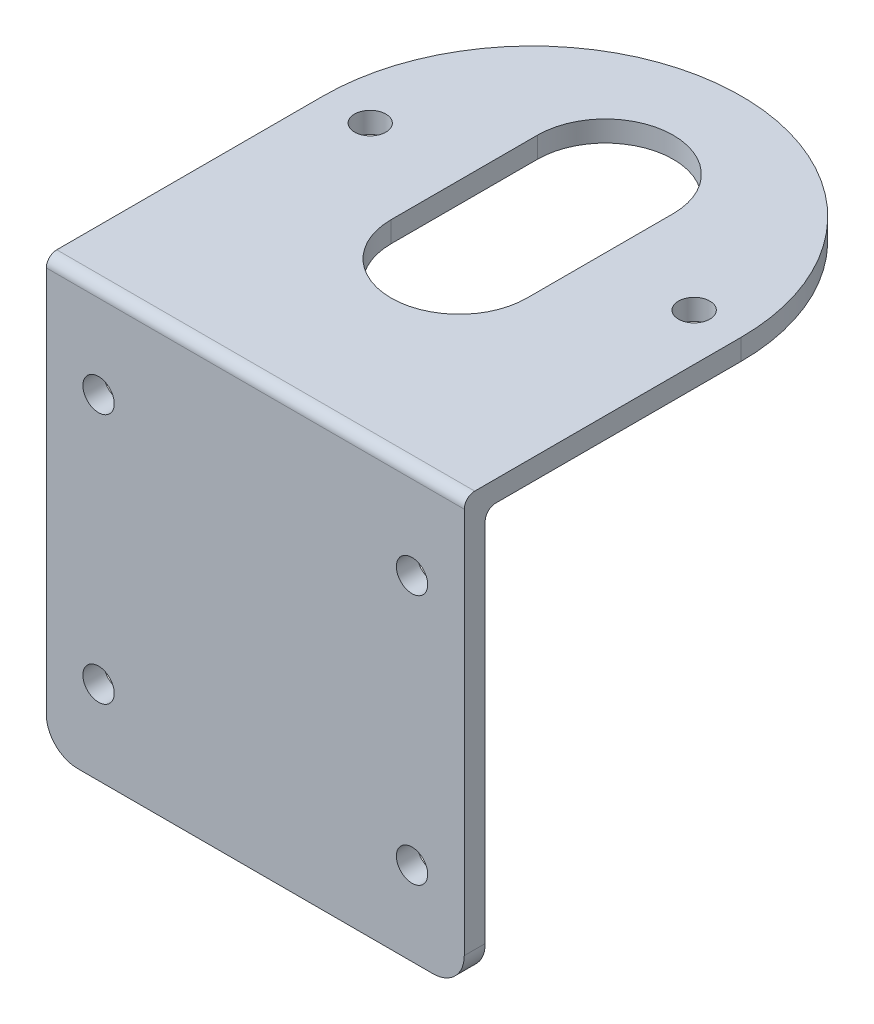
ISO-10303-21;
HEADER;
FILE_DESCRIPTION(('STEP AP214'),'2;1');
FILE_NAME('part.step','',(''),(''),'','','');
FILE_SCHEMA(('AUTOMOTIVE_DESIGN { 1 0 10303 214 1 1 1 1 }'));
ENDSEC;
DATA;
#1=APPLICATION_CONTEXT('core data for automotive mechanical design processes');
#2=APPLICATION_PROTOCOL_DEFINITION('international standard','automotive_design',2000,#1);
#3=PRODUCT_CONTEXT('',#1,'mechanical');
#4=PRODUCT('Part','Part','',(#3));
#5=PRODUCT_RELATED_PRODUCT_CATEGORY('part','',(#4));
#6=PRODUCT_DEFINITION_FORMATION('','',#4);
#7=PRODUCT_DEFINITION_CONTEXT('part definition',#1,'design');
#8=PRODUCT_DEFINITION('design','',#6,#7);
#9=PRODUCT_DEFINITION_SHAPE('','',#8);
#10=(LENGTH_UNIT() NAMED_UNIT(*) SI_UNIT(.MILLI.,.METRE.));
#11=(NAMED_UNIT(*) PLANE_ANGLE_UNIT() SI_UNIT($,.RADIAN.));
#12=(NAMED_UNIT(*) SI_UNIT($,.STERADIAN.) SOLID_ANGLE_UNIT());
#13=UNCERTAINTY_MEASURE_WITH_UNIT(LENGTH_MEASURE(1.E-05),#10,'distance_accuracy_value','');
#14=(GEOMETRIC_REPRESENTATION_CONTEXT(3) GLOBAL_UNCERTAINTY_ASSIGNED_CONTEXT((#13)) GLOBAL_UNIT_ASSIGNED_CONTEXT((#10,
#11,#12)) REPRESENTATION_CONTEXT('',''));
#15=CARTESIAN_POINT('',(0.,0.,0.));
#16=DIRECTION('',(0.,0.,1.));
#17=DIRECTION('',(1.,0.,0.));
#18=AXIS2_PLACEMENT_3D('',#15,#16,#17);
#19=CARTESIAN_POINT('',(0.,0.,0.));
#20=DIRECTION('',(0.,0.,1.));
#21=DIRECTION('',(1.,0.,0.));
#22=AXIS2_PLACEMENT_3D('',#19,#20,#21);
#23=PLANE('',#22);
#24=CARTESIAN_POINT('',(-15.,11.5,0.));
#25=DIRECTION('',(0.,0.,1.));
#26=DIRECTION('',(1.,0.,0.));
#27=AXIS2_PLACEMENT_3D('',#24,#25,#26);
#28=CIRCLE('',#27,1.5);
#29=CARTESIAN_POINT('',(-13.5,11.5,0.));
#30=VERTEX_POINT('',#29);
#31=EDGE_CURVE('E205',#30,#30,#28,.T.);
#32=ORIENTED_EDGE('',*,*,#31,.T.);
#33=EDGE_LOOP('',(#32));
#34=FACE_BOUND('',#33,.T.);
#35=CARTESIAN_POINT('',(-15.,-12.5,0.));
#36=DIRECTION('',(0.,0.,1.));
#37=DIRECTION('',(1.,0.,0.));
#38=AXIS2_PLACEMENT_3D('',#35,#36,#37);
#39=CIRCLE('',#38,1.5);
#40=CARTESIAN_POINT('',(-13.5,-12.5,0.));
#41=VERTEX_POINT('',#40);
#42=EDGE_CURVE('E202',#41,#41,#39,.T.);
#43=ORIENTED_EDGE('',*,*,#42,.T.);
#44=EDGE_LOOP('',(#43));
#45=FACE_BOUND('',#44,.T.);
#46=CARTESIAN_POINT('',(15.,-12.5,0.));
#47=DIRECTION('',(0.,0.,1.));
#48=DIRECTION('',(1.,0.,0.));
#49=AXIS2_PLACEMENT_3D('',#46,#47,#48);
#50=CIRCLE('',#49,1.5);
#51=CARTESIAN_POINT('',(16.5,-12.5,0.));
#52=VERTEX_POINT('',#51);
#53=EDGE_CURVE('E198',#52,#52,#50,.T.);
#54=ORIENTED_EDGE('',*,*,#53,.T.);
#55=EDGE_LOOP('',(#54));
#56=FACE_BOUND('',#55,.T.);
#57=CARTESIAN_POINT('',(15.,11.5,0.));
#58=DIRECTION('',(0.,0.,1.));
#59=DIRECTION('',(1.,0.,0.));
#60=AXIS2_PLACEMENT_3D('',#57,#58,#59);
#61=CIRCLE('',#60,1.5);
#62=CARTESIAN_POINT('',(16.5,11.5,0.));
#63=VERTEX_POINT('',#62);
#64=EDGE_CURVE('E195',#63,#63,#61,.T.);
#65=ORIENTED_EDGE('',*,*,#64,.T.);
#66=EDGE_LOOP('',(#65));
#67=FACE_BOUND('',#66,.T.);
#68=DIRECTION('',(-1.,0.,0.));
#69=VECTOR('',#68,1.);
#70=CARTESIAN_POINT('',(0.,-20.5,0.));
#71=LINE('',#70,#69);
#72=CARTESIAN_POINT('',(17.,-20.5,0.));
#73=VERTEX_POINT('',#72);
#74=CARTESIAN_POINT('',(-17.,-20.5,0.));
#75=VERTEX_POINT('',#74);
#76=EDGE_CURVE('E180',#73,#75,#71,.T.);
#77=ORIENTED_EDGE('',*,*,#76,.T.);
#78=CARTESIAN_POINT('',(-17.,-17.5,0.));
#79=DIRECTION('',(0.,0.,1.));
#80=DIRECTION('',(1.,0.,0.));
#81=AXIS2_PLACEMENT_3D('',#78,#79,#80);
#82=CIRCLE('',#81,3.);
#83=CARTESIAN_POINT('',(-20.,-17.5,0.));
#84=VERTEX_POINT('',#83);
#85=EDGE_CURVE('E242',#75,#84,#82,.F.);
#86=ORIENTED_EDGE('',*,*,#85,.T.);
#87=DIRECTION('',(0.,1.,0.));
#88=VECTOR('',#87,1.);
#89=CARTESIAN_POINT('',(-20.,0.,0.));
#90=LINE('',#89,#88);
#91=CARTESIAN_POINT('',(-20.,17.5,0.));
#92=VERTEX_POINT('',#91);
#93=EDGE_CURVE('E210',#84,#92,#90,.T.);
#94=ORIENTED_EDGE('',*,*,#93,.T.);
#95=DIRECTION('',(-1.,0.,0.));
#96=VECTOR('',#95,1.);
#97=CARTESIAN_POINT('',(20.,17.5,0.));
#98=LINE('',#97,#96);
#99=CARTESIAN_POINT('',(20.,17.5,0.));
#100=VERTEX_POINT('',#99);
#101=EDGE_CURVE('E218',#92,#100,#98,.F.);
#102=ORIENTED_EDGE('',*,*,#101,.T.);
#103=DIRECTION('',(0.,1.,0.));
#104=VECTOR('',#103,1.);
#105=CARTESIAN_POINT('',(20.,0.,0.));
#106=LINE('',#105,#104);
#107=CARTESIAN_POINT('',(20.,-17.5,0.));
#108=VERTEX_POINT('',#107);
#109=EDGE_CURVE('E208',#108,#100,#106,.T.);
#110=ORIENTED_EDGE('',*,*,#109,.F.);
#111=CARTESIAN_POINT('',(17.,-17.5,0.));
#112=DIRECTION('',(0.,0.,1.));
#113=DIRECTION('',(1.,0.,0.));
#114=AXIS2_PLACEMENT_3D('',#111,#112,#113);
#115=CIRCLE('',#114,3.);
#116=EDGE_CURVE('E240',#108,#73,#115,.F.);
#117=ORIENTED_EDGE('',*,*,#116,.T.);
#118=EDGE_LOOP('',(#77,#86,#94,#102,#110,#117));
#119=FACE_BOUND('',#118,.T.);
#120=ADVANCED_FACE('F36',(#34,#45,#56,#67,#119),#23,.F.);
#121=CARTESIAN_POINT('',(20.,0.,2.));
#122=DIRECTION('',(-1.,0.,0.));
#123=DIRECTION('',(0.,-1.,0.));
#124=AXIS2_PLACEMENT_3D('',#121,#122,#123);
#125=PLANE('',#124);
#126=DIRECTION('',(0.,1.,0.));
#127=VECTOR('',#126,1.);
#128=CARTESIAN_POINT('',(20.,0.,2.));
#129=LINE('',#128,#127);
#130=CARTESIAN_POINT('',(20.,-17.5,2.));
#131=VERTEX_POINT('',#130);
#132=CARTESIAN_POINT('',(20.,19.5,2.));
#133=VERTEX_POINT('',#132);
#134=EDGE_CURVE('E189',#131,#133,#129,.T.);
#135=ORIENTED_EDGE('',*,*,#134,.F.);
#136=DIRECTION('',(0.,0.,-1.));
#137=VECTOR('',#136,1.);
#138=CARTESIAN_POINT('',(20.,-17.5,0.));
#139=LINE('',#138,#137);
#140=EDGE_CURVE('E11',#131,#108,#139,.T.);
#141=ORIENTED_EDGE('',*,*,#140,.T.);
#142=ORIENTED_EDGE('',*,*,#109,.T.);
#143=CARTESIAN_POINT('',(20.,17.5,-1.));
#144=DIRECTION('',(-1.,0.,0.));
#145=DIRECTION('',(0.,-1.,0.));
#146=AXIS2_PLACEMENT_3D('',#143,#144,#145);
#147=CIRCLE('',#146,1.);
#148=CARTESIAN_POINT('',(20.,18.5,-1.));
#149=VERTEX_POINT('',#148);
#150=EDGE_CURVE('E233',#100,#149,#147,.T.);
#151=ORIENTED_EDGE('',*,*,#150,.T.);
#152=DIRECTION('',(0.,0.,-1.));
#153=VECTOR('',#152,1.);
#154=CARTESIAN_POINT('',(20.,18.5,0.));
#155=LINE('',#154,#153);
#156=CARTESIAN_POINT('',(20.,18.5,-24.5));
#157=VERTEX_POINT('',#156);
#158=EDGE_CURVE('E314',#149,#157,#155,.T.);
#159=ORIENTED_EDGE('',*,*,#158,.T.);
#160=DIRECTION('',(0.,-1.,0.));
#161=VECTOR('',#160,1.);
#162=CARTESIAN_POINT('',(20.,20.5,-24.5));
#163=LINE('',#162,#161);
#164=CARTESIAN_POINT('',(20.,20.5,-24.5));
#165=VERTEX_POINT('',#164);
#166=EDGE_CURVE('E168',#165,#157,#163,.T.);
#167=ORIENTED_EDGE('',*,*,#166,.F.);
#168=DIRECTION('',(0.,0.,-1.));
#169=VECTOR('',#168,1.);
#170=CARTESIAN_POINT('',(20.,20.5,2.));
#171=LINE('',#170,#169);
#172=CARTESIAN_POINT('',(20.,20.5,1.));
#173=VERTEX_POINT('',#172);
#174=EDGE_CURVE('E150',#173,#165,#171,.T.);
#175=ORIENTED_EDGE('',*,*,#174,.F.);
#176=CARTESIAN_POINT('',(20.,19.5,1.));
#177=DIRECTION('',(-1.,0.,0.));
#178=DIRECTION('',(0.,-1.,0.));
#179=AXIS2_PLACEMENT_3D('',#176,#177,#178);
#180=CIRCLE('',#179,1.);
#181=EDGE_CURVE('E223',#173,#133,#180,.F.);
#182=ORIENTED_EDGE('',*,*,#181,.T.);
#183=EDGE_LOOP('',(#135,#141,#142,#151,#159,#167,#175,#182));
#184=FACE_BOUND('',#183,.T.);
#185=ADVANCED_FACE('F264',(#184),#125,.F.);
#186=CARTESIAN_POINT('',(0.,20.5,2.));
#187=DIRECTION('',(0.,1.,0.));
#188=DIRECTION('',(-1.,0.,0.));
#189=AXIS2_PLACEMENT_3D('',#186,#187,#188);
#190=PLANE('',#189);
#191=DIRECTION('',(0.,0.,-1.));
#192=VECTOR('',#191,1.);
#193=CARTESIAN_POINT('',(-20.,20.5,2.));
#194=LINE('',#193,#192);
#195=CARTESIAN_POINT('',(-20.,20.5,1.));
#196=VERTEX_POINT('',#195);
#197=CARTESIAN_POINT('',(-20.,20.5,-24.5));
#198=VERTEX_POINT('',#197);
#199=EDGE_CURVE('E138',#196,#198,#194,.T.);
#200=ORIENTED_EDGE('',*,*,#199,.F.);
#201=DIRECTION('',(1.,0.,0.));
#202=VECTOR('',#201,1.);
#203=CARTESIAN_POINT('',(0.,20.5,1.));
#204=LINE('',#203,#202);
#205=EDGE_CURVE('E221',#196,#173,#204,.T.);
#206=ORIENTED_EDGE('',*,*,#205,.T.);
#207=ORIENTED_EDGE('',*,*,#174,.T.);
#208=CARTESIAN_POINT('',(0.,20.5,-24.5));
#209=DIRECTION('',(0.,1.,0.));
#210=DIRECTION('',(-1.,0.,0.));
#211=AXIS2_PLACEMENT_3D('',#208,#209,#210);
#212=CIRCLE('',#211,20.);
#213=EDGE_CURVE('E154',#165,#198,#212,.T.);
#214=ORIENTED_EDGE('',*,*,#213,.T.);
#215=EDGE_LOOP('',(#200,#206,#207,#214));
#216=FACE_BOUND('',#215,.T.);
#217=CARTESIAN_POINT('',(15.5,20.5,-24.5));
#218=DIRECTION('',(0.,1.,0.));
#219=DIRECTION('',(-1.,0.,0.));
#220=AXIS2_PLACEMENT_3D('',#217,#218,#219);
#221=CIRCLE('',#220,1.50175896182333);
#222=CARTESIAN_POINT('',(13.9982410381767,20.5,-24.5));
#223=VERTEX_POINT('',#222);
#224=EDGE_CURVE('E172',#223,#223,#221,.T.);
#225=ORIENTED_EDGE('',*,*,#224,.F.);
#226=EDGE_LOOP('',(#225));
#227=FACE_BOUND('',#226,.T.);
#228=CARTESIAN_POINT('',(0.,20.5,-17.5));
#229=DIRECTION('',(0.,1.,0.));
#230=DIRECTION('',(-1.,0.,0.));
#231=AXIS2_PLACEMENT_3D('',#228,#229,#230);
#232=CIRCLE('',#231,6.5);
#233=CARTESIAN_POINT('',(-6.49999999999999,20.5,-17.5));
#234=VERTEX_POINT('',#233);
#235=CARTESIAN_POINT('',(6.50000000000001,20.5,-17.5));
#236=VERTEX_POINT('',#235);
#237=EDGE_CURVE('E366',#234,#236,#232,.T.);
#238=ORIENTED_EDGE('',*,*,#237,.F.);
#239=DIRECTION('',(0.,0.,1.));
#240=VECTOR('',#239,1.);
#241=CARTESIAN_POINT('',(-6.49999999999999,20.5,0.));
#242=LINE('',#241,#240);
#243=CARTESIAN_POINT('',(-6.5,20.5,-31.5));
#244=VERTEX_POINT('',#243);
#245=EDGE_CURVE('E348',#244,#234,#242,.T.);
#246=ORIENTED_EDGE('',*,*,#245,.F.);
#247=CARTESIAN_POINT('',(0.,20.5,-31.5));
#248=DIRECTION('',(0.,1.,0.));
#249=DIRECTION('',(-1.,0.,0.));
#250=AXIS2_PLACEMENT_3D('',#247,#248,#249);
#251=CIRCLE('',#250,6.5);
#252=CARTESIAN_POINT('',(6.5,20.5,-31.5));
#253=VERTEX_POINT('',#252);
#254=EDGE_CURVE('E363',#253,#244,#251,.T.);
#255=ORIENTED_EDGE('',*,*,#254,.F.);
#256=DIRECTION('',(0.,0.,1.));
#257=VECTOR('',#256,1.);
#258=CARTESIAN_POINT('',(6.50000000000001,20.5,0.));
#259=LINE('',#258,#257);
#260=EDGE_CURVE('E368',#253,#236,#259,.T.);
#261=ORIENTED_EDGE('',*,*,#260,.T.);
#262=EDGE_LOOP('',(#238,#246,#255,#261));
#263=FACE_BOUND('',#262,.T.);
#264=CARTESIAN_POINT('',(-15.5,20.5,-24.5));
#265=DIRECTION('',(0.,1.,0.));
#266=DIRECTION('',(-1.,0.,0.));
#267=AXIS2_PLACEMENT_3D('',#264,#265,#266);
#268=CIRCLE('',#267,1.5);
#269=CARTESIAN_POINT('',(-17.,20.5,-24.5));
#270=VERTEX_POINT('',#269);
#271=EDGE_CURVE('E161',#270,#270,#268,.T.);
#272=ORIENTED_EDGE('',*,*,#271,.F.);
#273=EDGE_LOOP('',(#272));
#274=FACE_BOUND('',#273,.T.);
#275=ADVANCED_FACE('F155',(#216,#227,#263,#274),#190,.T.);
#276=CARTESIAN_POINT('',(-20.,0.,2.));
#277=DIRECTION('',(-1.,0.,0.));
#278=DIRECTION('',(0.,0.,1.));
#279=AXIS2_PLACEMENT_3D('',#276,#277,#278);
#280=PLANE('',#279);
#281=ORIENTED_EDGE('',*,*,#93,.F.);
#282=DIRECTION('',(0.,0.,-1.));
#283=VECTOR('',#282,1.);
#284=CARTESIAN_POINT('',(-20.,-17.5,2.));
#285=LINE('',#284,#283);
#286=CARTESIAN_POINT('',(-20.,-17.5,2.));
#287=VERTEX_POINT('',#286);
#288=EDGE_CURVE('E59',#84,#287,#285,.F.);
#289=ORIENTED_EDGE('',*,*,#288,.T.);
#290=DIRECTION('',(0.,1.,0.));
#291=VECTOR('',#290,1.);
#292=CARTESIAN_POINT('',(-20.,0.,2.));
#293=LINE('',#292,#291);
#294=CARTESIAN_POINT('',(-20.,19.5,2.));
#295=VERTEX_POINT('',#294);
#296=EDGE_CURVE('E191',#287,#295,#293,.T.);
#297=ORIENTED_EDGE('',*,*,#296,.T.);
#298=CARTESIAN_POINT('',(-20.,19.5,1.));
#299=DIRECTION('',(-1.,0.,0.));
#300=DIRECTION('',(0.,0.,1.));
#301=AXIS2_PLACEMENT_3D('',#298,#299,#300);
#302=CIRCLE('',#301,1.);
#303=EDGE_CURVE('E146',#295,#196,#302,.T.);
#304=ORIENTED_EDGE('',*,*,#303,.T.);
#305=ORIENTED_EDGE('',*,*,#199,.T.);
#306=DIRECTION('',(0.,-1.,0.));
#307=VECTOR('',#306,1.);
#308=CARTESIAN_POINT('',(-20.,20.5,-24.5));
#309=LINE('',#308,#307);
#310=CARTESIAN_POINT('',(-20.,18.5,-24.5));
#311=VERTEX_POINT('',#310);
#312=EDGE_CURVE('E143',#198,#311,#309,.T.);
#313=ORIENTED_EDGE('',*,*,#312,.T.);
#314=DIRECTION('',(0.,0.,-1.));
#315=VECTOR('',#314,1.);
#316=CARTESIAN_POINT('',(-20.,18.5,0.));
#317=LINE('',#316,#315);
#318=CARTESIAN_POINT('',(-20.,18.5,-1.));
#319=VERTEX_POINT('',#318);
#320=EDGE_CURVE('E257',#319,#311,#317,.T.);
#321=ORIENTED_EDGE('',*,*,#320,.F.);
#322=CARTESIAN_POINT('',(-20.,17.5,-1.));
#323=DIRECTION('',(-1.,0.,0.));
#324=DIRECTION('',(0.,0.,1.));
#325=AXIS2_PLACEMENT_3D('',#322,#323,#324);
#326=CIRCLE('',#325,1.);
#327=EDGE_CURVE('E230',#319,#92,#326,.F.);
#328=ORIENTED_EDGE('',*,*,#327,.T.);
#329=EDGE_LOOP('',(#281,#289,#297,#304,#305,#313,#321,#328));
#330=FACE_BOUND('',#329,.T.);
#331=ADVANCED_FACE('F140',(#330),#280,.T.);
#332=CARTESIAN_POINT('',(-15.,11.5,2.));
#333=DIRECTION('',(0.,0.,-1.));
#334=DIRECTION('',(-1.,0.,0.));
#335=AXIS2_PLACEMENT_3D('',#332,#333,#334);
#336=CYLINDRICAL_SURFACE('',#335,1.5);
#337=CARTESIAN_POINT('',(-15.,11.5,2.));
#338=DIRECTION('',(0.,0.,1.));
#339=DIRECTION('',(1.,0.,0.));
#340=AXIS2_PLACEMENT_3D('',#337,#338,#339);
#341=CIRCLE('',#340,1.5);
#342=CARTESIAN_POINT('',(-13.5,11.5,2.));
#343=VERTEX_POINT('',#342);
#344=EDGE_CURVE('E186',#343,#343,#341,.T.);
#345=ORIENTED_EDGE('',*,*,#344,.T.);
#346=EDGE_LOOP('',(#345));
#347=FACE_BOUND('',#346,.T.);
#348=ORIENTED_EDGE('',*,*,#31,.F.);
#349=EDGE_LOOP('',(#348));
#350=FACE_BOUND('',#349,.T.);
#351=ADVANCED_FACE('F289',(#347,#350),#336,.F.);
#352=CARTESIAN_POINT('',(-15.,-12.5,2.));
#353=DIRECTION('',(0.,0.,-1.));
#354=DIRECTION('',(-1.,0.,0.));
#355=AXIS2_PLACEMENT_3D('',#352,#353,#354);
#356=CYLINDRICAL_SURFACE('',#355,1.5);
#357=CARTESIAN_POINT('',(-15.,-12.5,2.));
#358=DIRECTION('',(0.,0.,1.));
#359=DIRECTION('',(1.,0.,0.));
#360=AXIS2_PLACEMENT_3D('',#357,#358,#359);
#361=CIRCLE('',#360,1.5);
#362=CARTESIAN_POINT('',(-13.5,-12.5,2.));
#363=VERTEX_POINT('',#362);
#364=EDGE_CURVE('E183',#363,#363,#361,.T.);
#365=ORIENTED_EDGE('',*,*,#364,.T.);
#366=EDGE_LOOP('',(#365));
#367=FACE_BOUND('',#366,.T.);
#368=ORIENTED_EDGE('',*,*,#42,.F.);
#369=EDGE_LOOP('',(#368));
#370=FACE_BOUND('',#369,.T.);
#371=ADVANCED_FACE('F294',(#367,#370),#356,.F.);
#372=CARTESIAN_POINT('',(15.,-12.5,2.));
#373=DIRECTION('',(0.,0.,-1.));
#374=DIRECTION('',(-1.,0.,0.));
#375=AXIS2_PLACEMENT_3D('',#372,#373,#374);
#376=CYLINDRICAL_SURFACE('',#375,1.5);
#377=CARTESIAN_POINT('',(15.,-12.5,2.));
#378=DIRECTION('',(0.,0.,1.));
#379=DIRECTION('',(1.,0.,0.));
#380=AXIS2_PLACEMENT_3D('',#377,#378,#379);
#381=CIRCLE('',#380,1.5);
#382=CARTESIAN_POINT('',(16.5,-12.5,2.));
#383=VERTEX_POINT('',#382);
#384=EDGE_CURVE('E179',#383,#383,#381,.T.);
#385=ORIENTED_EDGE('',*,*,#384,.T.);
#386=EDGE_LOOP('',(#385));
#387=FACE_BOUND('',#386,.T.);
#388=ORIENTED_EDGE('',*,*,#53,.F.);
#389=EDGE_LOOP('',(#388));
#390=FACE_BOUND('',#389,.T.);
#391=ADVANCED_FACE('F298',(#387,#390),#376,.F.);
#392=CARTESIAN_POINT('',(15.,11.5,2.));
#393=DIRECTION('',(0.,0.,-1.));
#394=DIRECTION('',(-1.,0.,0.));
#395=AXIS2_PLACEMENT_3D('',#392,#393,#394);
#396=CYLINDRICAL_SURFACE('',#395,1.5);
#397=CARTESIAN_POINT('',(15.,11.5,2.));
#398=DIRECTION('',(0.,0.,1.));
#399=DIRECTION('',(1.,0.,0.));
#400=AXIS2_PLACEMENT_3D('',#397,#398,#399);
#401=CIRCLE('',#400,1.5);
#402=CARTESIAN_POINT('',(16.5,11.5,2.));
#403=VERTEX_POINT('',#402);
#404=EDGE_CURVE('E176',#403,#403,#401,.T.);
#405=ORIENTED_EDGE('',*,*,#404,.T.);
#406=EDGE_LOOP('',(#405));
#407=FACE_BOUND('',#406,.T.);
#408=ORIENTED_EDGE('',*,*,#64,.F.);
#409=EDGE_LOOP('',(#408));
#410=FACE_BOUND('',#409,.T.);
#411=ADVANCED_FACE('F286',(#407,#410),#396,.F.);
#412=CARTESIAN_POINT('',(0.,-20.5,2.));
#413=DIRECTION('',(0.,-1.,0.));
#414=DIRECTION('',(1.,0.,0.));
#415=AXIS2_PLACEMENT_3D('',#412,#413,#414);
#416=PLANE('',#415);
#417=DIRECTION('',(-1.,0.,0.));
#418=VECTOR('',#417,1.);
#419=CARTESIAN_POINT('',(0.,-20.5,2.));
#420=LINE('',#419,#418);
#421=CARTESIAN_POINT('',(17.,-20.5,2.));
#422=VERTEX_POINT('',#421);
#423=CARTESIAN_POINT('',(-17.,-20.5,2.));
#424=VERTEX_POINT('',#423);
#425=EDGE_CURVE('E151',#422,#424,#420,.T.);
#426=ORIENTED_EDGE('',*,*,#425,.T.);
#427=DIRECTION('',(0.,0.,-1.));
#428=VECTOR('',#427,1.);
#429=CARTESIAN_POINT('',(-17.,-20.5,2.));
#430=LINE('',#429,#428);
#431=EDGE_CURVE('E237',#424,#75,#430,.T.);
#432=ORIENTED_EDGE('',*,*,#431,.T.);
#433=ORIENTED_EDGE('',*,*,#76,.F.);
#434=DIRECTION('',(0.,0.,-1.));
#435=VECTOR('',#434,1.);
#436=CARTESIAN_POINT('',(17.,-20.5,2.));
#437=LINE('',#436,#435);
#438=EDGE_CURVE('E235',#73,#422,#437,.F.);
#439=ORIENTED_EDGE('',*,*,#438,.T.);
#440=EDGE_LOOP('',(#426,#432,#433,#439));
#441=FACE_BOUND('',#440,.T.);
#442=ADVANCED_FACE('F251',(#441),#416,.T.);
#443=CARTESIAN_POINT('',(0.,0.,2.));
#444=DIRECTION('',(0.,0.,1.));
#445=DIRECTION('',(1.,0.,0.));
#446=AXIS2_PLACEMENT_3D('',#443,#444,#445);
#447=PLANE('',#446);
#448=ORIENTED_EDGE('',*,*,#296,.F.);
#449=CARTESIAN_POINT('',(-17.,-17.5,2.));
#450=DIRECTION('',(0.,0.,1.));
#451=DIRECTION('',(1.,0.,0.));
#452=AXIS2_PLACEMENT_3D('',#449,#450,#451);
#453=CIRCLE('',#452,3.);
#454=EDGE_CURVE('E44',#287,#424,#453,.T.);
#455=ORIENTED_EDGE('',*,*,#454,.T.);
#456=ORIENTED_EDGE('',*,*,#425,.F.);
#457=CARTESIAN_POINT('',(17.,-17.5,2.));
#458=DIRECTION('',(0.,0.,1.));
#459=DIRECTION('',(1.,0.,0.));
#460=AXIS2_PLACEMENT_3D('',#457,#458,#459);
#461=CIRCLE('',#460,3.);
#462=EDGE_CURVE('E51',#422,#131,#461,.T.);
#463=ORIENTED_EDGE('',*,*,#462,.T.);
#464=ORIENTED_EDGE('',*,*,#134,.T.);
#465=DIRECTION('',(1.,0.,0.));
#466=VECTOR('',#465,1.);
#467=CARTESIAN_POINT('',(0.,19.5,2.));
#468=LINE('',#467,#466);
#469=EDGE_CURVE('E226',#133,#295,#468,.F.);
#470=ORIENTED_EDGE('',*,*,#469,.T.);
#471=EDGE_LOOP('',(#448,#455,#456,#463,#464,#470));
#472=FACE_BOUND('',#471,.T.);
#473=ORIENTED_EDGE('',*,*,#404,.F.);
#474=EDGE_LOOP('',(#473));
#475=FACE_BOUND('',#474,.T.);
#476=ORIENTED_EDGE('',*,*,#384,.F.);
#477=EDGE_LOOP('',(#476));
#478=FACE_BOUND('',#477,.T.);
#479=ORIENTED_EDGE('',*,*,#364,.F.);
#480=EDGE_LOOP('',(#479));
#481=FACE_BOUND('',#480,.T.);
#482=ORIENTED_EDGE('',*,*,#344,.F.);
#483=EDGE_LOOP('',(#482));
#484=FACE_BOUND('',#483,.T.);
#485=ADVANCED_FACE('F246',(#472,#475,#478,#481,#484),#447,.T.);
#486=CARTESIAN_POINT('',(0.,18.5,0.));
#487=DIRECTION('',(0.,1.,0.));
#488=DIRECTION('',(-1.,0.,0.));
#489=AXIS2_PLACEMENT_3D('',#486,#487,#488);
#490=PLANE('',#489);
#491=CARTESIAN_POINT('',(-15.5,18.5,-24.5));
#492=DIRECTION('',(0.,1.,0.));
#493=DIRECTION('',(-1.,0.,0.));
#494=AXIS2_PLACEMENT_3D('',#491,#492,#493);
#495=CIRCLE('',#494,1.5);
#496=CARTESIAN_POINT('',(-17.,18.5,-24.5));
#497=VERTEX_POINT('',#496);
#498=EDGE_CURVE('E323',#497,#497,#495,.T.);
#499=ORIENTED_EDGE('',*,*,#498,.T.);
#500=EDGE_LOOP('',(#499));
#501=FACE_BOUND('',#500,.T.);
#502=CARTESIAN_POINT('',(0.,18.5,-17.5));
#503=DIRECTION('',(0.,1.,0.));
#504=DIRECTION('',(-1.,0.,0.));
#505=AXIS2_PLACEMENT_3D('',#502,#503,#504);
#506=CIRCLE('',#505,6.5);
#507=CARTESIAN_POINT('',(-6.49999999999999,18.5,-17.5));
#508=VERTEX_POINT('',#507);
#509=CARTESIAN_POINT('',(6.50000000000001,18.5,-17.5));
#510=VERTEX_POINT('',#509);
#511=EDGE_CURVE('E326',#508,#510,#506,.T.);
#512=ORIENTED_EDGE('',*,*,#511,.T.);
#513=DIRECTION('',(0.,0.,1.));
#514=VECTOR('',#513,1.);
#515=CARTESIAN_POINT('',(6.50000000000001,18.5,0.));
#516=LINE('',#515,#514);
#517=CARTESIAN_POINT('',(6.5,18.5,-31.5));
#518=VERTEX_POINT('',#517);
#519=EDGE_CURVE('E335',#518,#510,#516,.T.);
#520=ORIENTED_EDGE('',*,*,#519,.F.);
#521=CARTESIAN_POINT('',(0.,18.5,-31.5));
#522=DIRECTION('',(0.,1.,0.));
#523=DIRECTION('',(-1.,0.,0.));
#524=AXIS2_PLACEMENT_3D('',#521,#522,#523);
#525=CIRCLE('',#524,6.5);
#526=CARTESIAN_POINT('',(-6.5,18.5,-31.5));
#527=VERTEX_POINT('',#526);
#528=EDGE_CURVE('E332',#518,#527,#525,.T.);
#529=ORIENTED_EDGE('',*,*,#528,.T.);
#530=DIRECTION('',(0.,0.,1.));
#531=VECTOR('',#530,1.);
#532=CARTESIAN_POINT('',(-6.49999999999999,18.5,0.));
#533=LINE('',#532,#531);
#534=EDGE_CURVE('E329',#527,#508,#533,.T.);
#535=ORIENTED_EDGE('',*,*,#534,.T.);
#536=EDGE_LOOP('',(#512,#520,#529,#535));
#537=FACE_BOUND('',#536,.T.);
#538=CARTESIAN_POINT('',(15.5,18.5,-24.5));
#539=DIRECTION('',(0.,1.,0.));
#540=DIRECTION('',(-1.,0.,0.));
#541=AXIS2_PLACEMENT_3D('',#538,#539,#540);
#542=CIRCLE('',#541,1.50175896182333);
#543=CARTESIAN_POINT('',(13.9982410381767,18.5,-24.5));
#544=VERTEX_POINT('',#543);
#545=EDGE_CURVE('E162',#544,#544,#542,.T.);
#546=ORIENTED_EDGE('',*,*,#545,.T.);
#547=EDGE_LOOP('',(#546));
#548=FACE_BOUND('',#547,.T.);
#549=ORIENTED_EDGE('',*,*,#158,.F.);
#550=DIRECTION('',(-1.,0.,0.));
#551=VECTOR('',#550,1.);
#552=CARTESIAN_POINT('',(-20.,18.5,-1.));
#553=LINE('',#552,#551);
#554=EDGE_CURVE('E215',#149,#319,#553,.T.);
#555=ORIENTED_EDGE('',*,*,#554,.T.);
#556=ORIENTED_EDGE('',*,*,#320,.T.);
#557=CARTESIAN_POINT('',(0.,18.5,-24.5));
#558=DIRECTION('',(0.,1.,0.));
#559=DIRECTION('',(-1.,0.,0.));
#560=AXIS2_PLACEMENT_3D('',#557,#558,#559);
#561=CIRCLE('',#560,20.);
#562=EDGE_CURVE('E166',#157,#311,#561,.T.);
#563=ORIENTED_EDGE('',*,*,#562,.F.);
#564=EDGE_LOOP('',(#549,#555,#556,#563));
#565=FACE_BOUND('',#564,.T.);
#566=ADVANCED_FACE('F316',(#501,#537,#548,#565),#490,.F.);
#567=CARTESIAN_POINT('',(0.,20.5,-17.5));
#568=DIRECTION('',(0.,-1.,0.));
#569=DIRECTION('',(1.,0.,0.));
#570=AXIS2_PLACEMENT_3D('',#567,#568,#569);
#571=CYLINDRICAL_SURFACE('',#570,6.5);
#572=ORIENTED_EDGE('',*,*,#511,.F.);
#573=DIRECTION('',(0.,-1.,0.));
#574=VECTOR('',#573,1.);
#575=CARTESIAN_POINT('',(-6.49999999999999,20.5,-17.5));
#576=LINE('',#575,#574);
#577=EDGE_CURVE('E199',#234,#508,#576,.T.);
#578=ORIENTED_EDGE('',*,*,#577,.F.);
#579=ORIENTED_EDGE('',*,*,#237,.T.);
#580=DIRECTION('',(0.,-1.,0.));
#581=VECTOR('',#580,1.);
#582=CARTESIAN_POINT('',(6.50000000000001,20.5,-17.5));
#583=LINE('',#582,#581);
#584=EDGE_CURVE('E167',#236,#510,#583,.T.);
#585=ORIENTED_EDGE('',*,*,#584,.T.);
#586=EDGE_LOOP('',(#572,#578,#579,#585));
#587=FACE_BOUND('',#586,.T.);
#588=ADVANCED_FACE('F352',(#587),#571,.F.);
#589=CARTESIAN_POINT('',(-6.49999999999999,20.5,0.));
#590=DIRECTION('',(1.,0.,0.));
#591=DIRECTION('',(0.,0.,-1.));
#592=AXIS2_PLACEMENT_3D('',#589,#590,#591);
#593=PLANE('',#592);
#594=ORIENTED_EDGE('',*,*,#534,.F.);
#595=DIRECTION('',(0.,-1.,0.));
#596=VECTOR('',#595,1.);
#597=CARTESIAN_POINT('',(-6.5,20.5,-31.5));
#598=LINE('',#597,#596);
#599=EDGE_CURVE('E341',#244,#527,#598,.T.);
#600=ORIENTED_EDGE('',*,*,#599,.F.);
#601=ORIENTED_EDGE('',*,*,#245,.T.);
#602=ORIENTED_EDGE('',*,*,#577,.T.);
#603=EDGE_LOOP('',(#594,#600,#601,#602));
#604=FACE_BOUND('',#603,.T.);
#605=ADVANCED_FACE('F346',(#604),#593,.T.);
#606=CARTESIAN_POINT('',(0.,20.5,-31.5));
#607=DIRECTION('',(0.,-1.,0.));
#608=DIRECTION('',(1.,0.,0.));
#609=AXIS2_PLACEMENT_3D('',#606,#607,#608);
#610=CYLINDRICAL_SURFACE('',#609,6.5);
#611=ORIENTED_EDGE('',*,*,#528,.F.);
#612=DIRECTION('',(0.,-1.,0.));
#613=VECTOR('',#612,1.);
#614=CARTESIAN_POINT('',(6.5,20.5,-31.5));
#615=LINE('',#614,#613);
#616=EDGE_CURVE('E170',#253,#518,#615,.T.);
#617=ORIENTED_EDGE('',*,*,#616,.F.);
#618=ORIENTED_EDGE('',*,*,#254,.T.);
#619=ORIENTED_EDGE('',*,*,#599,.T.);
#620=EDGE_LOOP('',(#611,#617,#618,#619));
#621=FACE_BOUND('',#620,.T.);
#622=ADVANCED_FACE('F359',(#621),#610,.F.);
#623=CARTESIAN_POINT('',(0.,20.5,-24.5));
#624=DIRECTION('',(0.,-1.,0.));
#625=DIRECTION('',(1.,0.,0.));
#626=AXIS2_PLACEMENT_3D('',#623,#624,#625);
#627=CYLINDRICAL_SURFACE('',#626,20.);
#628=ORIENTED_EDGE('',*,*,#562,.T.);
#629=ORIENTED_EDGE('',*,*,#312,.F.);
#630=ORIENTED_EDGE('',*,*,#213,.F.);
#631=ORIENTED_EDGE('',*,*,#166,.T.);
#632=EDGE_LOOP('',(#628,#629,#630,#631));
#633=FACE_BOUND('',#632,.T.);
#634=ADVANCED_FACE('F164',(#633),#627,.T.);
#635=CARTESIAN_POINT('',(6.50000000000001,20.5,0.));
#636=DIRECTION('',(1.,0.,0.));
#637=DIRECTION('',(0.,0.,-1.));
#638=AXIS2_PLACEMENT_3D('',#635,#636,#637);
#639=PLANE('',#638);
#640=ORIENTED_EDGE('',*,*,#519,.T.);
#641=ORIENTED_EDGE('',*,*,#584,.F.);
#642=ORIENTED_EDGE('',*,*,#260,.F.);
#643=ORIENTED_EDGE('',*,*,#616,.T.);
#644=EDGE_LOOP('',(#640,#641,#642,#643));
#645=FACE_BOUND('',#644,.T.);
#646=ADVANCED_FACE('F389',(#645),#639,.F.);
#647=CARTESIAN_POINT('',(-15.5,20.5,-24.5));
#648=DIRECTION('',(0.,-1.,0.));
#649=DIRECTION('',(1.,0.,0.));
#650=AXIS2_PLACEMENT_3D('',#647,#648,#649);
#651=CYLINDRICAL_SURFACE('',#650,1.5);
#652=ORIENTED_EDGE('',*,*,#271,.T.);
#653=EDGE_LOOP('',(#652));
#654=FACE_BOUND('',#653,.T.);
#655=ORIENTED_EDGE('',*,*,#498,.F.);
#656=EDGE_LOOP('',(#655));
#657=FACE_BOUND('',#656,.T.);
#658=ADVANCED_FACE('F377',(#654,#657),#651,.F.);
#659=CARTESIAN_POINT('',(15.5,20.5,-24.5));
#660=DIRECTION('',(0.,-1.,0.));
#661=DIRECTION('',(1.,0.,0.));
#662=AXIS2_PLACEMENT_3D('',#659,#660,#661);
#663=CYLINDRICAL_SURFACE('',#662,1.50175896182333);
#664=ORIENTED_EDGE('',*,*,#224,.T.);
#665=EDGE_LOOP('',(#664));
#666=FACE_BOUND('',#665,.T.);
#667=ORIENTED_EDGE('',*,*,#545,.F.);
#668=EDGE_LOOP('',(#667));
#669=FACE_BOUND('',#668,.T.);
#670=ADVANCED_FACE('F308',(#666,#669),#663,.F.);
#671=CARTESIAN_POINT('',(0.,17.5,-1.));
#672=DIRECTION('',(1.,0.,0.));
#673=DIRECTION('',(0.,1.,0.));
#674=AXIS2_PLACEMENT_3D('',#671,#672,#673);
#675=CYLINDRICAL_SURFACE('',#674,1.);
#676=ORIENTED_EDGE('',*,*,#150,.F.);
#677=ORIENTED_EDGE('',*,*,#101,.F.);
#678=ORIENTED_EDGE('',*,*,#327,.F.);
#679=ORIENTED_EDGE('',*,*,#554,.F.);
#680=EDGE_LOOP('',(#676,#677,#678,#679));
#681=FACE_BOUND('',#680,.T.);
#682=ADVANCED_FACE('F261',(#681),#675,.F.);
#683=CARTESIAN_POINT('',(0.,19.5,1.));
#684=DIRECTION('',(1.,0.,0.));
#685=DIRECTION('',(0.,1.,0.));
#686=AXIS2_PLACEMENT_3D('',#683,#684,#685);
#687=CYLINDRICAL_SURFACE('',#686,1.);
#688=ORIENTED_EDGE('',*,*,#303,.F.);
#689=ORIENTED_EDGE('',*,*,#469,.F.);
#690=ORIENTED_EDGE('',*,*,#181,.F.);
#691=ORIENTED_EDGE('',*,*,#205,.F.);
#692=EDGE_LOOP('',(#688,#689,#690,#691));
#693=FACE_BOUND('',#692,.T.);
#694=ADVANCED_FACE('F272',(#693),#687,.T.);
#695=CARTESIAN_POINT('',(-17.,-17.5,2.));
#696=DIRECTION('',(0.,0.,-1.));
#697=DIRECTION('',(-1.,0.,0.));
#698=AXIS2_PLACEMENT_3D('',#695,#696,#697);
#699=CYLINDRICAL_SURFACE('',#698,3.);
#700=ORIENTED_EDGE('',*,*,#454,.F.);
#701=ORIENTED_EDGE('',*,*,#288,.F.);
#702=ORIENTED_EDGE('',*,*,#85,.F.);
#703=ORIENTED_EDGE('',*,*,#431,.F.);
#704=EDGE_LOOP('',(#700,#701,#702,#703));
#705=FACE_BOUND('',#704,.T.);
#706=ADVANCED_FACE('F254',(#705),#699,.T.);
#707=CARTESIAN_POINT('',(17.,-17.5,2.));
#708=DIRECTION('',(0.,0.,1.));
#709=DIRECTION('',(1.,0.,0.));
#710=AXIS2_PLACEMENT_3D('',#707,#708,#709);
#711=CYLINDRICAL_SURFACE('',#710,3.);
#712=ORIENTED_EDGE('',*,*,#462,.F.);
#713=ORIENTED_EDGE('',*,*,#438,.F.);
#714=ORIENTED_EDGE('',*,*,#116,.F.);
#715=ORIENTED_EDGE('',*,*,#140,.F.);
#716=EDGE_LOOP('',(#712,#713,#714,#715));
#717=FACE_BOUND('',#716,.T.);
#718=ADVANCED_FACE('F38',(#717),#711,.T.);
#719=CLOSED_SHELL('',(#120,#185,#275,#331,#351,#371,#391,#411,#442,#485,#566,#588,#605,#622,
#634,#646,#658,#670,#682,#694,#706,#718));
#720=MANIFOLD_SOLID_BREP('B2',#719);
#721=ADVANCED_BREP_SHAPE_REPRESENTATION('',(#18,#720),#14);
#722=SHAPE_DEFINITION_REPRESENTATION(#9,#721);
ENDSEC;
END-ISO-10303-21;
